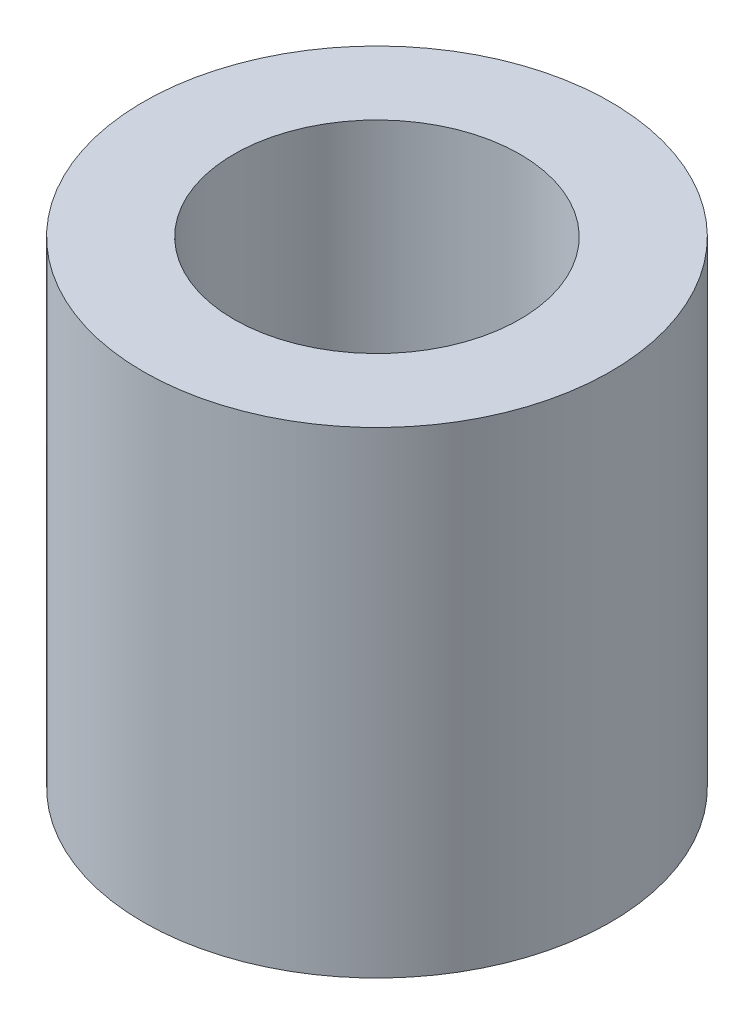
ISO-10303-21;
HEADER;
FILE_DESCRIPTION(('STEP AP214'),'2;1');
FILE_NAME('part.step','',(''),(''),'','','');
FILE_SCHEMA(('AUTOMOTIVE_DESIGN { 1 0 10303 214 1 1 1 1 }'));
ENDSEC;
DATA;
#1=APPLICATION_CONTEXT('core data for automotive mechanical design processes');
#2=APPLICATION_PROTOCOL_DEFINITION('international standard','automotive_design',2000,#1);
#3=PRODUCT_CONTEXT('',#1,'mechanical');
#4=PRODUCT('Part','Part','',(#3));
#5=PRODUCT_RELATED_PRODUCT_CATEGORY('part','',(#4));
#6=PRODUCT_DEFINITION_FORMATION('','',#4);
#7=PRODUCT_DEFINITION_CONTEXT('part definition',#1,'design');
#8=PRODUCT_DEFINITION('design','',#6,#7);
#9=PRODUCT_DEFINITION_SHAPE('','',#8);
#10=(LENGTH_UNIT() NAMED_UNIT(*) SI_UNIT(.MILLI.,.METRE.));
#11=(NAMED_UNIT(*) PLANE_ANGLE_UNIT() SI_UNIT($,.RADIAN.));
#12=(NAMED_UNIT(*) SI_UNIT($,.STERADIAN.) SOLID_ANGLE_UNIT());
#13=UNCERTAINTY_MEASURE_WITH_UNIT(LENGTH_MEASURE(1.E-05),#10,'distance_accuracy_value','');
#14=(GEOMETRIC_REPRESENTATION_CONTEXT(3) GLOBAL_UNCERTAINTY_ASSIGNED_CONTEXT((#13)) GLOBAL_UNIT_ASSIGNED_CONTEXT((#10,
#11,#12)) REPRESENTATION_CONTEXT('',''));
#15=CARTESIAN_POINT('',(0.,0.,0.));
#16=DIRECTION('',(0.,0.,1.));
#17=DIRECTION('',(1.,0.,0.));
#18=AXIS2_PLACEMENT_3D('',#15,#16,#17);
#19=CARTESIAN_POINT('',(0.,10.,0.));
#20=DIRECTION('',(0.,-1.,0.));
#21=DIRECTION('',(0.,0.,-1.));
#22=AXIS2_PLACEMENT_3D('',#19,#20,#21);
#23=CYLINDRICAL_SURFACE('',#22,4.9);
#24=CARTESIAN_POINT('',(0.,10.,0.));
#25=DIRECTION('',(0.,1.,0.));
#26=DIRECTION('',(0.,0.,1.));
#27=AXIS2_PLACEMENT_3D('',#24,#25,#26);
#28=CIRCLE('',#27,4.9);
#29=CARTESIAN_POINT('',(0.,10.,4.9));
#30=VERTEX_POINT('',#29);
#31=EDGE_CURVE('E10',#30,#30,#28,.T.);
#32=ORIENTED_EDGE('',*,*,#31,.F.);
#33=EDGE_LOOP('',(#32));
#34=FACE_BOUND('',#33,.T.);
#35=CARTESIAN_POINT('',(0.,0.,0.));
#36=DIRECTION('',(0.,1.,0.));
#37=DIRECTION('',(0.,0.,1.));
#38=AXIS2_PLACEMENT_3D('',#35,#36,#37);
#39=CIRCLE('',#38,4.9);
#40=CARTESIAN_POINT('',(0.,0.,4.9));
#41=VERTEX_POINT('',#40);
#42=EDGE_CURVE('E35',#41,#41,#39,.T.);
#43=ORIENTED_EDGE('',*,*,#42,.T.);
#44=EDGE_LOOP('',(#43));
#45=FACE_BOUND('',#44,.T.);
#46=ADVANCED_FACE('F32',(#34,#45),#23,.T.);
#47=CARTESIAN_POINT('',(0.,10.,0.));
#48=DIRECTION('',(0.,1.,0.));
#49=DIRECTION('',(0.,0.,1.));
#50=AXIS2_PLACEMENT_3D('',#47,#48,#49);
#51=PLANE('',#50);
#52=CARTESIAN_POINT('',(0.,10.,0.));
#53=DIRECTION('',(0.,1.,0.));
#54=DIRECTION('',(0.,0.,1.));
#55=AXIS2_PLACEMENT_3D('',#52,#53,#54);
#56=CIRCLE('',#55,3.);
#57=CARTESIAN_POINT('',(0.,10.,3.));
#58=VERTEX_POINT('',#57);
#59=EDGE_CURVE('E44',#58,#58,#56,.T.);
#60=ORIENTED_EDGE('',*,*,#59,.F.);
#61=EDGE_LOOP('',(#60));
#62=FACE_BOUND('',#61,.T.);
#63=ORIENTED_EDGE('',*,*,#31,.T.);
#64=EDGE_LOOP('',(#63));
#65=FACE_BOUND('',#64,.T.);
#66=ADVANCED_FACE('F59',(#62,#65),#51,.T.);
#67=CARTESIAN_POINT('',(0.,0.,0.));
#68=DIRECTION('',(0.,1.,0.));
#69=DIRECTION('',(0.,0.,1.));
#70=AXIS2_PLACEMENT_3D('',#67,#68,#69);
#71=PLANE('',#70);
#72=CARTESIAN_POINT('',(0.,0.,0.));
#73=DIRECTION('',(0.,1.,0.));
#74=DIRECTION('',(0.,0.,1.));
#75=AXIS2_PLACEMENT_3D('',#72,#73,#74);
#76=CIRCLE('',#75,3.);
#77=CARTESIAN_POINT('',(0.,0.,3.));
#78=VERTEX_POINT('',#77);
#79=EDGE_CURVE('E42',#78,#78,#76,.T.);
#80=ORIENTED_EDGE('',*,*,#79,.T.);
#81=EDGE_LOOP('',(#80));
#82=FACE_BOUND('',#81,.T.);
#83=ORIENTED_EDGE('',*,*,#42,.F.);
#84=EDGE_LOOP('',(#83));
#85=FACE_BOUND('',#84,.T.);
#86=ADVANCED_FACE('F50',(#82,#85),#71,.F.);
#87=CARTESIAN_POINT('',(0.,0.,0.));
#88=DIRECTION('',(0.,1.,0.));
#89=DIRECTION('',(0.,0.,1.));
#90=AXIS2_PLACEMENT_3D('',#87,#88,#89);
#91=CYLINDRICAL_SURFACE('',#90,3.);
#92=ORIENTED_EDGE('',*,*,#79,.F.);
#93=EDGE_LOOP('',(#92));
#94=FACE_BOUND('',#93,.T.);
#95=ORIENTED_EDGE('',*,*,#59,.T.);
#96=EDGE_LOOP('',(#95));
#97=FACE_BOUND('',#96,.T.);
#98=ADVANCED_FACE('F53',(#94,#97),#91,.F.);
#99=CLOSED_SHELL('',(#46,#66,#86,#98));
#100=MANIFOLD_SOLID_BREP('B2',#99);
#101=ADVANCED_BREP_SHAPE_REPRESENTATION('',(#18,#100),#14);
#102=SHAPE_DEFINITION_REPRESENTATION(#9,#101);
ENDSEC;
END-ISO-10303-21;
